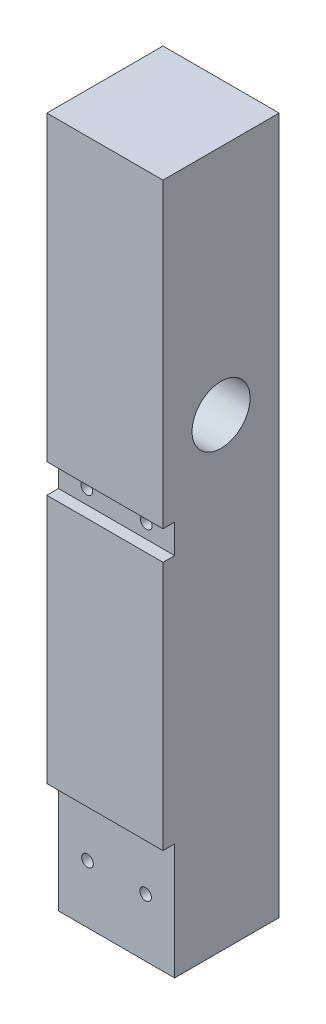
ISO-10303-21;
HEADER;
FILE_DESCRIPTION(('STEP AP214'),'2;1');
FILE_NAME('part.step','',(''),(''),'','','');
FILE_SCHEMA(('AUTOMOTIVE_DESIGN { 1 0 10303 214 1 1 1 1 }'));
ENDSEC;
DATA;
#1=APPLICATION_CONTEXT('core data for automotive mechanical design processes');
#2=APPLICATION_PROTOCOL_DEFINITION('international standard','automotive_design',2000,#1);
#3=PRODUCT_CONTEXT('',#1,'mechanical');
#4=PRODUCT('Part','Part','',(#3));
#5=PRODUCT_RELATED_PRODUCT_CATEGORY('part','',(#4));
#6=PRODUCT_DEFINITION_FORMATION('','',#4);
#7=PRODUCT_DEFINITION_CONTEXT('part definition',#1,'design');
#8=PRODUCT_DEFINITION('design','',#6,#7);
#9=PRODUCT_DEFINITION_SHAPE('','',#8);
#10=(LENGTH_UNIT() NAMED_UNIT(*) SI_UNIT(.MILLI.,.METRE.));
#11=(NAMED_UNIT(*) PLANE_ANGLE_UNIT() SI_UNIT($,.RADIAN.));
#12=(NAMED_UNIT(*) SI_UNIT($,.STERADIAN.) SOLID_ANGLE_UNIT());
#13=UNCERTAINTY_MEASURE_WITH_UNIT(LENGTH_MEASURE(1.E-05),#10,'distance_accuracy_value','');
#14=(GEOMETRIC_REPRESENTATION_CONTEXT(3) GLOBAL_UNCERTAINTY_ASSIGNED_CONTEXT((#13)) GLOBAL_UNIT_ASSIGNED_CONTEXT((#10,
#11,#12)) REPRESENTATION_CONTEXT('',''));
#15=CARTESIAN_POINT('',(0.,0.,0.));
#16=DIRECTION('',(0.,0.,1.));
#17=DIRECTION('',(1.,0.,0.));
#18=AXIS2_PLACEMENT_3D('',#15,#16,#17);
#19=CARTESIAN_POINT('',(-15.119461257796,65.5,0.));
#20=DIRECTION('',(0.,0.,-1.));
#21=DIRECTION('',(0.,1.,0.));
#22=AXIS2_PLACEMENT_3D('',#19,#20,#21);
#23=CYLINDRICAL_SURFACE('',#22,1.);
#24=CARTESIAN_POINT('',(-15.119461257796,65.5,-15.));
#25=DIRECTION('',(0.,0.,-1.));
#26=DIRECTION('',(0.,1.,0.));
#27=AXIS2_PLACEMENT_3D('',#24,#25,#26);
#28=CIRCLE('',#27,1.);
#29=CARTESIAN_POINT('',(-15.119461257796,66.5,-15.));
#30=VERTEX_POINT('',#29);
#31=EDGE_CURVE('E42',#30,#30,#28,.T.);
#32=ORIENTED_EDGE('',*,*,#31,.T.);
#33=EDGE_LOOP('',(#32));
#34=FACE_BOUND('',#33,.T.);
#35=CARTESIAN_POINT('',(-15.119461257796,65.5,-2.));
#36=DIRECTION('',(0.,0.,1.));
#37=DIRECTION('',(1.,0.,0.));
#38=AXIS2_PLACEMENT_3D('',#35,#36,#37);
#39=CIRCLE('',#38,1.);
#40=CARTESIAN_POINT('',(-14.119461257796,65.5,-2.));
#41=VERTEX_POINT('',#40);
#42=EDGE_CURVE('E173',#41,#41,#39,.T.);
#43=ORIENTED_EDGE('',*,*,#42,.T.);
#44=EDGE_LOOP('',(#43));
#45=FACE_BOUND('',#44,.T.);
#46=ADVANCED_FACE('F38',(#34,#45),#23,.F.);
#47=CARTESIAN_POINT('',(-4.88053874220398,65.5,0.));
#48=DIRECTION('',(0.,0.,-1.));
#49=DIRECTION('',(0.,1.,0.));
#50=AXIS2_PLACEMENT_3D('',#47,#48,#49);
#51=CYLINDRICAL_SURFACE('',#50,1.);
#52=CARTESIAN_POINT('',(-4.88053874220398,65.5,-15.));
#53=DIRECTION('',(0.,0.,-1.));
#54=DIRECTION('',(0.,1.,0.));
#55=AXIS2_PLACEMENT_3D('',#52,#53,#54);
#56=CIRCLE('',#55,1.);
#57=CARTESIAN_POINT('',(-4.88053874220398,66.5,-15.));
#58=VERTEX_POINT('',#57);
#59=EDGE_CURVE('E180',#58,#58,#56,.F.);
#60=ORIENTED_EDGE('',*,*,#59,.F.);
#61=EDGE_LOOP('',(#60));
#62=FACE_BOUND('',#61,.T.);
#63=CARTESIAN_POINT('',(-4.88053874220398,65.5,-2.));
#64=DIRECTION('',(0.,0.,1.));
#65=DIRECTION('',(1.,0.,0.));
#66=AXIS2_PLACEMENT_3D('',#63,#64,#65);
#67=CIRCLE('',#66,1.);
#68=CARTESIAN_POINT('',(-3.88053874220398,65.5,-2.));
#69=VERTEX_POINT('',#68);
#70=EDGE_CURVE('E170',#69,#69,#67,.F.);
#71=ORIENTED_EDGE('',*,*,#70,.F.);
#72=EDGE_LOOP('',(#71));
#73=FACE_BOUND('',#72,.T.);
#74=ADVANCED_FACE('F321',(#62,#73),#51,.F.);
#75=CARTESIAN_POINT('',(-20.,120.,0.));
#76=DIRECTION('',(0.,0.,1.));
#77=DIRECTION('',(0.,-1.,0.));
#78=AXIS2_PLACEMENT_3D('',#75,#76,#77);
#79=PLANE('',#78);
#80=DIRECTION('',(1.,0.,0.));
#81=VECTOR('',#80,1.);
#82=CARTESIAN_POINT('',(-20.,63.,0.));
#83=LINE('',#82,#81);
#84=CARTESIAN_POINT('',(-20.,63.,0.));
#85=VERTEX_POINT('',#84);
#86=CARTESIAN_POINT('',(0.,63.,0.));
#87=VERTEX_POINT('',#86);
#88=EDGE_CURVE('E133',#85,#87,#83,.T.);
#89=ORIENTED_EDGE('',*,*,#88,.F.);
#90=DIRECTION('',(0.,-1.,0.));
#91=VECTOR('',#90,1.);
#92=CARTESIAN_POINT('',(-20.,120.,0.));
#93=LINE('',#92,#91);
#94=CARTESIAN_POINT('',(-20.,20.,0.));
#95=VERTEX_POINT('',#94);
#96=EDGE_CURVE('E218',#85,#95,#93,.T.);
#97=ORIENTED_EDGE('',*,*,#96,.T.);
#98=DIRECTION('',(-1.,0.,0.));
#99=VECTOR('',#98,1.);
#100=CARTESIAN_POINT('',(-20.,20.,0.));
#101=LINE('',#100,#99);
#102=CARTESIAN_POINT('',(0.,20.,0.));
#103=VERTEX_POINT('',#102);
#104=EDGE_CURVE('E150',#103,#95,#101,.T.);
#105=ORIENTED_EDGE('',*,*,#104,.F.);
#106=DIRECTION('',(0.,-1.,0.));
#107=VECTOR('',#106,1.);
#108=CARTESIAN_POINT('',(0.,120.,0.));
#109=LINE('',#108,#107);
#110=EDGE_CURVE('E213',#87,#103,#109,.T.);
#111=ORIENTED_EDGE('',*,*,#110,.F.);
#112=EDGE_LOOP('',(#89,#97,#105,#111));
#113=FACE_BOUND('',#112,.T.);
#114=ADVANCED_FACE('F298',(#113),#79,.T.);
#115=CARTESIAN_POINT('',(-5.,9.99999999999999,-20.));
#116=DIRECTION('',(0.,0.,1.));
#117=DIRECTION('',(1.,0.,0.));
#118=AXIS2_PLACEMENT_3D('',#115,#116,#117);
#119=CYLINDRICAL_SURFACE('',#118,1.);
#120=CARTESIAN_POINT('',(-5.,9.99999999999999,-15.));
#121=DIRECTION('',(0.,0.,-1.));
#122=DIRECTION('',(0.,1.,0.));
#123=AXIS2_PLACEMENT_3D('',#120,#121,#122);
#124=CIRCLE('',#123,1.);
#125=CARTESIAN_POINT('',(-5.,11.,-15.));
#126=VERTEX_POINT('',#125);
#127=EDGE_CURVE('E209',#126,#126,#124,.T.);
#128=ORIENTED_EDGE('',*,*,#127,.T.);
#129=EDGE_LOOP('',(#128));
#130=FACE_BOUND('',#129,.T.);
#131=CARTESIAN_POINT('',(-5.,9.99999999999999,-2.));
#132=DIRECTION('',(0.,0.,1.));
#133=DIRECTION('',(1.,0.,0.));
#134=AXIS2_PLACEMENT_3D('',#131,#132,#133);
#135=CIRCLE('',#134,1.);
#136=CARTESIAN_POINT('',(-4.,9.99999999999999,-2.));
#137=VERTEX_POINT('',#136);
#138=EDGE_CURVE('E166',#137,#137,#135,.T.);
#139=ORIENTED_EDGE('',*,*,#138,.T.);
#140=EDGE_LOOP('',(#139));
#141=FACE_BOUND('',#140,.T.);
#142=ADVANCED_FACE('F317',(#130,#141),#119,.F.);
#143=CARTESIAN_POINT('',(-15.,9.99999999999999,-20.));
#144=DIRECTION('',(0.,0.,1.));
#145=DIRECTION('',(1.,0.,0.));
#146=AXIS2_PLACEMENT_3D('',#143,#144,#145);
#147=CYLINDRICAL_SURFACE('',#146,1.);
#148=CARTESIAN_POINT('',(-15.,9.99999999999999,-15.));
#149=DIRECTION('',(0.,0.,-1.));
#150=DIRECTION('',(0.,1.,0.));
#151=AXIS2_PLACEMENT_3D('',#148,#149,#150);
#152=CIRCLE('',#151,1.);
#153=CARTESIAN_POINT('',(-15.,11.,-15.));
#154=VERTEX_POINT('',#153);
#155=EDGE_CURVE('E192',#154,#154,#152,.F.);
#156=ORIENTED_EDGE('',*,*,#155,.F.);
#157=EDGE_LOOP('',(#156));
#158=FACE_BOUND('',#157,.T.);
#159=CARTESIAN_POINT('',(-15.,9.99999999999999,-2.));
#160=DIRECTION('',(0.,0.,1.));
#161=DIRECTION('',(1.,0.,0.));
#162=AXIS2_PLACEMENT_3D('',#159,#160,#161);
#163=CIRCLE('',#162,1.);
#164=CARTESIAN_POINT('',(-14.,9.99999999999999,-2.));
#165=VERTEX_POINT('',#164);
#166=EDGE_CURVE('E163',#165,#165,#163,.F.);
#167=ORIENTED_EDGE('',*,*,#166,.F.);
#168=EDGE_LOOP('',(#167));
#169=FACE_BOUND('',#168,.T.);
#170=ADVANCED_FACE('F312',(#158,#169),#147,.F.);
#171=CARTESIAN_POINT('',(-20.,0.,0.));
#172=DIRECTION('',(0.,-1.,0.));
#173=DIRECTION('',(0.,0.,-1.));
#174=AXIS2_PLACEMENT_3D('',#171,#172,#173);
#175=PLANE('',#174);
#176=DIRECTION('',(0.,0.,-1.));
#177=VECTOR('',#176,1.);
#178=CARTESIAN_POINT('',(0.,0.,0.));
#179=LINE('',#178,#177);
#180=CARTESIAN_POINT('',(0.,0.,-2.));
#181=VERTEX_POINT('',#180);
#182=CARTESIAN_POINT('',(0.,0.,-20.));
#183=VERTEX_POINT('',#182);
#184=EDGE_CURVE('E228',#181,#183,#179,.T.);
#185=ORIENTED_EDGE('',*,*,#184,.F.);
#186=DIRECTION('',(1.,0.,0.));
#187=VECTOR('',#186,1.);
#188=CARTESIAN_POINT('',(-20.,0.,-2.));
#189=LINE('',#188,#187);
#190=CARTESIAN_POINT('',(-20.,0.,-2.));
#191=VERTEX_POINT('',#190);
#192=EDGE_CURVE('E63',#191,#181,#189,.T.);
#193=ORIENTED_EDGE('',*,*,#192,.F.);
#194=DIRECTION('',(0.,0.,-1.));
#195=VECTOR('',#194,1.);
#196=CARTESIAN_POINT('',(-20.,0.,0.));
#197=LINE('',#196,#195);
#198=CARTESIAN_POINT('',(-20.,0.,-20.));
#199=VERTEX_POINT('',#198);
#200=EDGE_CURVE('E217',#191,#199,#197,.T.);
#201=ORIENTED_EDGE('',*,*,#200,.T.);
#202=DIRECTION('',(1.,0.,0.));
#203=VECTOR('',#202,1.);
#204=CARTESIAN_POINT('',(-20.,0.,-20.));
#205=LINE('',#204,#203);
#206=EDGE_CURVE('E226',#199,#183,#205,.T.);
#207=ORIENTED_EDGE('',*,*,#206,.T.);
#208=EDGE_LOOP('',(#185,#193,#201,#207));
#209=FACE_BOUND('',#208,.T.);
#210=ADVANCED_FACE('F310',(#209),#175,.T.);
#211=DIRECTION('',(-1.,0.,0.));
#212=VECTOR('',#211,1.);
#213=CARTESIAN_POINT('',(-20.,68.,0.));
#214=LINE('',#213,#212);
#215=CARTESIAN_POINT('',(0.,68.,0.));
#216=VERTEX_POINT('',#215);
#217=CARTESIAN_POINT('',(-20.,68.,0.));
#218=VERTEX_POINT('',#217);
#219=EDGE_CURVE('E161',#216,#218,#214,.T.);
#220=ORIENTED_EDGE('',*,*,#219,.F.);
#221=CARTESIAN_POINT('',(0.,120.,0.));
#222=VERTEX_POINT('',#221);
#223=EDGE_CURVE('E140',#222,#216,#109,.T.);
#224=ORIENTED_EDGE('',*,*,#223,.F.);
#225=DIRECTION('',(1.,0.,0.));
#226=VECTOR('',#225,1.);
#227=CARTESIAN_POINT('',(-20.,120.,0.));
#228=LINE('',#227,#226);
#229=CARTESIAN_POINT('',(-20.,120.,0.));
#230=VERTEX_POINT('',#229);
#231=EDGE_CURVE('E12',#230,#222,#228,.T.);
#232=ORIENTED_EDGE('',*,*,#231,.F.);
#233=EDGE_CURVE('E214',#230,#218,#93,.T.);
#234=ORIENTED_EDGE('',*,*,#233,.T.);
#235=EDGE_LOOP('',(#220,#224,#232,#234));
#236=FACE_BOUND('',#235,.T.);
#237=ADVANCED_FACE('F40',(#236),#79,.T.);
#238=CARTESIAN_POINT('',(-20.,120.,-20.));
#239=DIRECTION('',(0.,0.,-1.));
#240=DIRECTION('',(0.,1.,0.));
#241=AXIS2_PLACEMENT_3D('',#238,#239,#240);
#242=PLANE('',#241);
#243=CARTESIAN_POINT('',(-4.88053874220398,65.5,-20.));
#244=DIRECTION('',(0.,0.,-1.));
#245=DIRECTION('',(0.,1.,0.));
#246=AXIS2_PLACEMENT_3D('',#243,#244,#245);
#247=CIRCLE('',#246,2.);
#248=CARTESIAN_POINT('',(-4.88053874220398,67.5,-20.));
#249=VERTEX_POINT('',#248);
#250=EDGE_CURVE('E181',#249,#249,#247,.T.);
#251=ORIENTED_EDGE('',*,*,#250,.F.);
#252=EDGE_LOOP('',(#251));
#253=FACE_BOUND('',#252,.T.);
#254=CARTESIAN_POINT('',(-15.119461257796,65.5,-20.));
#255=DIRECTION('',(0.,0.,-1.));
#256=DIRECTION('',(0.,1.,0.));
#257=AXIS2_PLACEMENT_3D('',#254,#255,#256);
#258=CIRCLE('',#257,2.);
#259=CARTESIAN_POINT('',(-15.119461257796,67.5,-20.));
#260=VERTEX_POINT('',#259);
#261=EDGE_CURVE('E176',#260,#260,#258,.T.);
#262=ORIENTED_EDGE('',*,*,#261,.F.);
#263=EDGE_LOOP('',(#262));
#264=FACE_BOUND('',#263,.T.);
#265=CARTESIAN_POINT('',(-5.,9.99999999999999,-20.));
#266=DIRECTION('',(0.,0.,-1.));
#267=DIRECTION('',(0.,1.,0.));
#268=AXIS2_PLACEMENT_3D('',#265,#266,#267);
#269=CIRCLE('',#268,2.);
#270=CARTESIAN_POINT('',(-5.,12.,-20.));
#271=VERTEX_POINT('',#270);
#272=EDGE_CURVE('E193',#271,#271,#269,.T.);
#273=ORIENTED_EDGE('',*,*,#272,.F.);
#274=EDGE_LOOP('',(#273));
#275=FACE_BOUND('',#274,.T.);
#276=CARTESIAN_POINT('',(-15.,9.99999999999999,-20.));
#277=DIRECTION('',(0.,0.,-1.));
#278=DIRECTION('',(0.,1.,0.));
#279=AXIS2_PLACEMENT_3D('',#276,#277,#278);
#280=CIRCLE('',#279,2.);
#281=CARTESIAN_POINT('',(-15.,12.,-20.));
#282=VERTEX_POINT('',#281);
#283=EDGE_CURVE('E199',#282,#282,#280,.T.);
#284=ORIENTED_EDGE('',*,*,#283,.F.);
#285=EDGE_LOOP('',(#284));
#286=FACE_BOUND('',#285,.T.);
#287=DIRECTION('',(0.,1.,0.));
#288=VECTOR('',#287,1.);
#289=CARTESIAN_POINT('',(0.,120.,-20.));
#290=LINE('',#289,#288);
#291=CARTESIAN_POINT('',(0.,120.,-20.));
#292=VERTEX_POINT('',#291);
#293=EDGE_CURVE('E230',#183,#292,#290,.T.);
#294=ORIENTED_EDGE('',*,*,#293,.F.);
#295=ORIENTED_EDGE('',*,*,#206,.F.);
#296=DIRECTION('',(0.,1.,0.));
#297=VECTOR('',#296,1.);
#298=CARTESIAN_POINT('',(-20.,120.,-20.));
#299=LINE('',#298,#297);
#300=CARTESIAN_POINT('',(-20.,120.,-20.));
#301=VERTEX_POINT('',#300);
#302=EDGE_CURVE('E220',#199,#301,#299,.T.);
#303=ORIENTED_EDGE('',*,*,#302,.T.);
#304=DIRECTION('',(1.,0.,0.));
#305=VECTOR('',#304,1.);
#306=CARTESIAN_POINT('',(-20.,120.,-20.));
#307=LINE('',#306,#305);
#308=EDGE_CURVE('E47',#301,#292,#307,.T.);
#309=ORIENTED_EDGE('',*,*,#308,.T.);
#310=EDGE_LOOP('',(#294,#295,#303,#309));
#311=FACE_BOUND('',#310,.T.);
#312=ADVANCED_FACE('F265',(#253,#264,#275,#286,#311),#242,.T.);
#313=CARTESIAN_POINT('',(-20.,80.,-10.));
#314=DIRECTION('',(1.,0.,0.));
#315=DIRECTION('',(0.,0.,-1.));
#316=AXIS2_PLACEMENT_3D('',#313,#314,#315);
#317=CYLINDRICAL_SURFACE('',#316,2.5);
#318=CARTESIAN_POINT('',(-20.,80.,-10.));
#319=DIRECTION('',(1.,0.,0.));
#320=DIRECTION('',(0.,0.,-1.));
#321=AXIS2_PLACEMENT_3D('',#318,#319,#320);
#322=CIRCLE('',#321,2.5);
#323=CARTESIAN_POINT('',(-20.,80.,-12.5));
#324=VERTEX_POINT('',#323);
#325=EDGE_CURVE('E210',#324,#324,#322,.T.);
#326=ORIENTED_EDGE('',*,*,#325,.F.);
#327=EDGE_LOOP('',(#326));
#328=FACE_BOUND('',#327,.T.);
#329=CARTESIAN_POINT('',(-10.,80.,-10.));
#330=DIRECTION('',(1.,0.,0.));
#331=DIRECTION('',(0.,0.,-1.));
#332=AXIS2_PLACEMENT_3D('',#329,#330,#331);
#333=CIRCLE('',#332,2.5);
#334=CARTESIAN_POINT('',(-10.,80.,-12.5));
#335=VERTEX_POINT('',#334);
#336=EDGE_CURVE('E205',#335,#335,#333,.F.);
#337=ORIENTED_EDGE('',*,*,#336,.F.);
#338=EDGE_LOOP('',(#337));
#339=FACE_BOUND('',#338,.T.);
#340=ADVANCED_FACE('F268',(#328,#339),#317,.F.);
#341=CARTESIAN_POINT('',(-20.,120.,0.));
#342=DIRECTION('',(0.,1.,0.));
#343=DIRECTION('',(0.,0.,1.));
#344=AXIS2_PLACEMENT_3D('',#341,#342,#343);
#345=PLANE('',#344);
#346=DIRECTION('',(0.,0.,1.));
#347=VECTOR('',#346,1.);
#348=CARTESIAN_POINT('',(0.,120.,0.));
#349=LINE('',#348,#347);
#350=EDGE_CURVE('E233',#292,#222,#349,.T.);
#351=ORIENTED_EDGE('',*,*,#350,.F.);
#352=ORIENTED_EDGE('',*,*,#308,.F.);
#353=DIRECTION('',(0.,0.,1.));
#354=VECTOR('',#353,1.);
#355=CARTESIAN_POINT('',(-20.,120.,0.));
#356=LINE('',#355,#354);
#357=EDGE_CURVE('E223',#301,#230,#356,.T.);
#358=ORIENTED_EDGE('',*,*,#357,.T.);
#359=ORIENTED_EDGE('',*,*,#231,.T.);
#360=EDGE_LOOP('',(#351,#352,#358,#359));
#361=FACE_BOUND('',#360,.T.);
#362=ADVANCED_FACE('F281',(#361),#345,.T.);
#363=CARTESIAN_POINT('',(-20.,0.,0.));
#364=DIRECTION('',(1.,0.,0.));
#365=DIRECTION('',(0.,0.,-1.));
#366=AXIS2_PLACEMENT_3D('',#363,#364,#365);
#367=PLANE('',#366);
#368=ORIENTED_EDGE('',*,*,#96,.F.);
#369=DIRECTION('',(0.,0.,1.));
#370=VECTOR('',#369,1.);
#371=CARTESIAN_POINT('',(-20.,63.,-2.));
#372=LINE('',#371,#370);
#373=CARTESIAN_POINT('',(-20.,63.,-2.));
#374=VERTEX_POINT('',#373);
#375=EDGE_CURVE('E142',#374,#85,#372,.T.);
#376=ORIENTED_EDGE('',*,*,#375,.F.);
#377=DIRECTION('',(0.,-1.,0.));
#378=VECTOR('',#377,1.);
#379=CARTESIAN_POINT('',(-20.,68.,-2.));
#380=LINE('',#379,#378);
#381=CARTESIAN_POINT('',(-20.,68.,-2.));
#382=VERTEX_POINT('',#381);
#383=EDGE_CURVE('E125',#382,#374,#380,.T.);
#384=ORIENTED_EDGE('',*,*,#383,.F.);
#385=DIRECTION('',(0.,0.,1.));
#386=VECTOR('',#385,1.);
#387=CARTESIAN_POINT('',(-20.,68.,-2.));
#388=LINE('',#387,#386);
#389=EDGE_CURVE('E123',#382,#218,#388,.T.);
#390=ORIENTED_EDGE('',*,*,#389,.T.);
#391=ORIENTED_EDGE('',*,*,#233,.F.);
#392=ORIENTED_EDGE('',*,*,#357,.F.);
#393=ORIENTED_EDGE('',*,*,#302,.F.);
#394=ORIENTED_EDGE('',*,*,#200,.F.);
#395=DIRECTION('',(0.,-1.,0.));
#396=VECTOR('',#395,1.);
#397=CARTESIAN_POINT('',(-20.,20.,-2.));
#398=LINE('',#397,#396);
#399=CARTESIAN_POINT('',(-20.,20.,-2.));
#400=VERTEX_POINT('',#399);
#401=EDGE_CURVE('E153',#400,#191,#398,.T.);
#402=ORIENTED_EDGE('',*,*,#401,.F.);
#403=DIRECTION('',(0.,0.,1.));
#404=VECTOR('',#403,1.);
#405=CARTESIAN_POINT('',(-20.,20.,-2.));
#406=LINE('',#405,#404);
#407=EDGE_CURVE('E158',#400,#95,#406,.T.);
#408=ORIENTED_EDGE('',*,*,#407,.T.);
#409=EDGE_LOOP('',(#368,#376,#384,#390,#391,#392,#393,#394,#402,#408));
#410=FACE_BOUND('',#409,.T.);
#411=ORIENTED_EDGE('',*,*,#325,.T.);
#412=EDGE_LOOP('',(#411));
#413=FACE_BOUND('',#412,.T.);
#414=ADVANCED_FACE('F301',(#410,#413),#367,.F.);
#415=CARTESIAN_POINT('',(0.,0.,0.));
#416=DIRECTION('',(1.,0.,0.));
#417=DIRECTION('',(0.,0.,-1.));
#418=AXIS2_PLACEMENT_3D('',#415,#416,#417);
#419=PLANE('',#418);
#420=DIRECTION('',(0.,0.,1.));
#421=VECTOR('',#420,1.);
#422=CARTESIAN_POINT('',(0.,63.,-2.));
#423=LINE('',#422,#421);
#424=CARTESIAN_POINT('',(0.,63.,-2.));
#425=VERTEX_POINT('',#424);
#426=EDGE_CURVE('E167',#425,#87,#423,.T.);
#427=ORIENTED_EDGE('',*,*,#426,.T.);
#428=ORIENTED_EDGE('',*,*,#110,.T.);
#429=DIRECTION('',(0.,0.,1.));
#430=VECTOR('',#429,1.);
#431=CARTESIAN_POINT('',(0.,20.,-2.));
#432=LINE('',#431,#430);
#433=CARTESIAN_POINT('',(0.,20.,-2.));
#434=VERTEX_POINT('',#433);
#435=EDGE_CURVE('E156',#434,#103,#432,.T.);
#436=ORIENTED_EDGE('',*,*,#435,.F.);
#437=DIRECTION('',(0.,1.,0.));
#438=VECTOR('',#437,1.);
#439=CARTESIAN_POINT('',(0.,20.,-2.));
#440=LINE('',#439,#438);
#441=EDGE_CURVE('E147',#181,#434,#440,.T.);
#442=ORIENTED_EDGE('',*,*,#441,.F.);
#443=ORIENTED_EDGE('',*,*,#184,.T.);
#444=ORIENTED_EDGE('',*,*,#293,.T.);
#445=ORIENTED_EDGE('',*,*,#350,.T.);
#446=ORIENTED_EDGE('',*,*,#223,.T.);
#447=DIRECTION('',(0.,0.,1.));
#448=VECTOR('',#447,1.);
#449=CARTESIAN_POINT('',(0.,68.,-2.));
#450=LINE('',#449,#448);
#451=CARTESIAN_POINT('',(0.,68.,-2.));
#452=VERTEX_POINT('',#451);
#453=EDGE_CURVE('E120',#452,#216,#450,.T.);
#454=ORIENTED_EDGE('',*,*,#453,.F.);
#455=DIRECTION('',(0.,1.,0.));
#456=VECTOR('',#455,1.);
#457=CARTESIAN_POINT('',(0.,68.,-2.));
#458=LINE('',#457,#456);
#459=EDGE_CURVE('E126',#425,#452,#458,.T.);
#460=ORIENTED_EDGE('',*,*,#459,.F.);
#461=EDGE_LOOP('',(#427,#428,#436,#442,#443,#444,#445,#446,#454,#460));
#462=FACE_BOUND('',#461,.T.);
#463=CARTESIAN_POINT('',(0.,80.,-10.));
#464=DIRECTION('',(1.,0.,0.));
#465=DIRECTION('',(0.,0.,-1.));
#466=AXIS2_PLACEMENT_3D('',#463,#464,#465);
#467=CIRCLE('',#466,5.);
#468=CARTESIAN_POINT('',(0.,80.,-15.));
#469=VERTEX_POINT('',#468);
#470=EDGE_CURVE('E206',#469,#469,#467,.T.);
#471=ORIENTED_EDGE('',*,*,#470,.F.);
#472=EDGE_LOOP('',(#471));
#473=FACE_BOUND('',#472,.T.);
#474=ADVANCED_FACE('F136',(#462,#473),#419,.T.);
#475=CARTESIAN_POINT('',(-10.,80.,-10.));
#476=DIRECTION('',(1.,0.,0.));
#477=DIRECTION('',(0.,0.,-1.));
#478=AXIS2_PLACEMENT_3D('',#475,#476,#477);
#479=PLANE('',#478);
#480=CARTESIAN_POINT('',(-10.,80.,-10.));
#481=DIRECTION('',(1.,0.,0.));
#482=DIRECTION('',(0.,0.,-1.));
#483=AXIS2_PLACEMENT_3D('',#480,#481,#482);
#484=CIRCLE('',#483,5.);
#485=CARTESIAN_POINT('',(-10.,80.,-15.));
#486=VERTEX_POINT('',#485);
#487=EDGE_CURVE('E202',#486,#486,#484,.T.);
#488=ORIENTED_EDGE('',*,*,#487,.T.);
#489=EDGE_LOOP('',(#488));
#490=FACE_BOUND('',#489,.T.);
#491=ORIENTED_EDGE('',*,*,#336,.T.);
#492=EDGE_LOOP('',(#491));
#493=FACE_BOUND('',#492,.T.);
#494=ADVANCED_FACE('F350',(#490,#493),#479,.T.);
#495=CARTESIAN_POINT('',(-10.,80.,-10.));
#496=DIRECTION('',(1.,0.,0.));
#497=DIRECTION('',(0.,0.,-1.));
#498=AXIS2_PLACEMENT_3D('',#495,#496,#497);
#499=CYLINDRICAL_SURFACE('',#498,5.);
#500=ORIENTED_EDGE('',*,*,#487,.F.);
#501=EDGE_LOOP('',(#500));
#502=FACE_BOUND('',#501,.T.);
#503=ORIENTED_EDGE('',*,*,#470,.T.);
#504=EDGE_LOOP('',(#503));
#505=FACE_BOUND('',#504,.T.);
#506=ADVANCED_FACE('F342',(#502,#505),#499,.F.);
#507=CARTESIAN_POINT('',(-15.,9.99999999999999,-15.));
#508=DIRECTION('',(0.,0.,-1.));
#509=DIRECTION('',(0.,1.,0.));
#510=AXIS2_PLACEMENT_3D('',#507,#508,#509);
#511=PLANE('',#510);
#512=CARTESIAN_POINT('',(-15.,9.99999999999999,-15.));
#513=DIRECTION('',(0.,0.,-1.));
#514=DIRECTION('',(0.,1.,0.));
#515=AXIS2_PLACEMENT_3D('',#512,#513,#514);
#516=CIRCLE('',#515,2.);
#517=CARTESIAN_POINT('',(-15.,12.,-15.));
#518=VERTEX_POINT('',#517);
#519=EDGE_CURVE('E196',#518,#518,#516,.T.);
#520=ORIENTED_EDGE('',*,*,#519,.T.);
#521=EDGE_LOOP('',(#520));
#522=FACE_BOUND('',#521,.T.);
#523=ORIENTED_EDGE('',*,*,#155,.T.);
#524=EDGE_LOOP('',(#523));
#525=FACE_BOUND('',#524,.T.);
#526=ADVANCED_FACE('F339',(#522,#525),#511,.T.);
#527=CARTESIAN_POINT('',(-15.,9.99999999999999,-15.));
#528=DIRECTION('',(0.,0.,-1.));
#529=DIRECTION('',(0.,1.,0.));
#530=AXIS2_PLACEMENT_3D('',#527,#528,#529);
#531=CYLINDRICAL_SURFACE('',#530,2.);
#532=ORIENTED_EDGE('',*,*,#519,.F.);
#533=EDGE_LOOP('',(#532));
#534=FACE_BOUND('',#533,.T.);
#535=ORIENTED_EDGE('',*,*,#283,.T.);
#536=EDGE_LOOP('',(#535));
#537=FACE_BOUND('',#536,.T.);
#538=ADVANCED_FACE('F337',(#534,#537),#531,.F.);
#539=CARTESIAN_POINT('',(-5.,9.99999999999999,-15.));
#540=DIRECTION('',(0.,0.,-1.));
#541=DIRECTION('',(0.,1.,0.));
#542=AXIS2_PLACEMENT_3D('',#539,#540,#541);
#543=CYLINDRICAL_SURFACE('',#542,2.);
#544=CARTESIAN_POINT('',(-5.,9.99999999999999,-15.));
#545=DIRECTION('',(0.,0.,-1.));
#546=DIRECTION('',(0.,1.,0.));
#547=AXIS2_PLACEMENT_3D('',#544,#545,#546);
#548=CIRCLE('',#547,2.);
#549=CARTESIAN_POINT('',(-5.,12.,-15.));
#550=VERTEX_POINT('',#549);
#551=EDGE_CURVE('E189',#550,#550,#548,.T.);
#552=ORIENTED_EDGE('',*,*,#551,.F.);
#553=EDGE_LOOP('',(#552));
#554=FACE_BOUND('',#553,.T.);
#555=ORIENTED_EDGE('',*,*,#272,.T.);
#556=EDGE_LOOP('',(#555));
#557=FACE_BOUND('',#556,.T.);
#558=ADVANCED_FACE('F333',(#554,#557),#543,.F.);
#559=CARTESIAN_POINT('',(-5.,9.99999999999999,-15.));
#560=DIRECTION('',(0.,0.,-1.));
#561=DIRECTION('',(0.,1.,0.));
#562=AXIS2_PLACEMENT_3D('',#559,#560,#561);
#563=PLANE('',#562);
#564=ORIENTED_EDGE('',*,*,#127,.F.);
#565=EDGE_LOOP('',(#564));
#566=FACE_BOUND('',#565,.T.);
#567=ORIENTED_EDGE('',*,*,#551,.T.);
#568=EDGE_LOOP('',(#567));
#569=FACE_BOUND('',#568,.T.);
#570=ADVANCED_FACE('F329',(#566,#569),#563,.T.);
#571=CARTESIAN_POINT('',(-4.88053874220398,65.5,-15.));
#572=DIRECTION('',(0.,0.,-1.));
#573=DIRECTION('',(0.,1.,0.));
#574=AXIS2_PLACEMENT_3D('',#571,#572,#573);
#575=PLANE('',#574);
#576=CARTESIAN_POINT('',(-4.88053874220398,65.5,-15.));
#577=DIRECTION('',(0.,0.,-1.));
#578=DIRECTION('',(0.,1.,0.));
#579=AXIS2_PLACEMENT_3D('',#576,#577,#578);
#580=CIRCLE('',#579,2.);
#581=CARTESIAN_POINT('',(-4.88053874220398,67.5,-15.));
#582=VERTEX_POINT('',#581);
#583=EDGE_CURVE('E177',#582,#582,#580,.T.);
#584=ORIENTED_EDGE('',*,*,#583,.T.);
#585=EDGE_LOOP('',(#584));
#586=FACE_BOUND('',#585,.T.);
#587=ORIENTED_EDGE('',*,*,#59,.T.);
#588=EDGE_LOOP('',(#587));
#589=FACE_BOUND('',#588,.T.);
#590=ADVANCED_FACE('F332',(#586,#589),#575,.T.);
#591=CARTESIAN_POINT('',(-4.88053874220398,65.5,-15.));
#592=DIRECTION('',(0.,0.,-1.));
#593=DIRECTION('',(0.,1.,0.));
#594=AXIS2_PLACEMENT_3D('',#591,#592,#593);
#595=CYLINDRICAL_SURFACE('',#594,2.);
#596=ORIENTED_EDGE('',*,*,#583,.F.);
#597=EDGE_LOOP('',(#596));
#598=FACE_BOUND('',#597,.T.);
#599=ORIENTED_EDGE('',*,*,#250,.T.);
#600=EDGE_LOOP('',(#599));
#601=FACE_BOUND('',#600,.T.);
#602=ADVANCED_FACE('F261',(#598,#601),#595,.F.);
#603=CARTESIAN_POINT('',(-15.119461257796,65.5,-15.));
#604=DIRECTION('',(0.,0.,-1.));
#605=DIRECTION('',(0.,1.,0.));
#606=AXIS2_PLACEMENT_3D('',#603,#604,#605);
#607=CYLINDRICAL_SURFACE('',#606,2.);
#608=CARTESIAN_POINT('',(-15.119461257796,65.5,-15.));
#609=DIRECTION('',(0.,0.,-1.));
#610=DIRECTION('',(0.,1.,0.));
#611=AXIS2_PLACEMENT_3D('',#608,#609,#610);
#612=CIRCLE('',#611,2.);
#613=CARTESIAN_POINT('',(-15.119461257796,67.5,-15.));
#614=VERTEX_POINT('',#613);
#615=EDGE_CURVE('E184',#614,#614,#612,.T.);
#616=ORIENTED_EDGE('',*,*,#615,.F.);
#617=EDGE_LOOP('',(#616));
#618=FACE_BOUND('',#617,.T.);
#619=ORIENTED_EDGE('',*,*,#261,.T.);
#620=EDGE_LOOP('',(#619));
#621=FACE_BOUND('',#620,.T.);
#622=ADVANCED_FACE('F255',(#618,#621),#607,.F.);
#623=CARTESIAN_POINT('',(-15.119461257796,65.5,-15.));
#624=DIRECTION('',(0.,0.,-1.));
#625=DIRECTION('',(0.,1.,0.));
#626=AXIS2_PLACEMENT_3D('',#623,#624,#625);
#627=PLANE('',#626);
#628=ORIENTED_EDGE('',*,*,#31,.F.);
#629=EDGE_LOOP('',(#628));
#630=FACE_BOUND('',#629,.T.);
#631=ORIENTED_EDGE('',*,*,#615,.T.);
#632=EDGE_LOOP('',(#631));
#633=FACE_BOUND('',#632,.T.);
#634=ADVANCED_FACE('F251',(#630,#633),#627,.T.);
#635=CARTESIAN_POINT('',(0.,0.,-2.));
#636=DIRECTION('',(0.,0.,1.));
#637=DIRECTION('',(1.,0.,0.));
#638=AXIS2_PLACEMENT_3D('',#635,#636,#637);
#639=PLANE('',#638);
#640=ORIENTED_EDGE('',*,*,#138,.F.);
#641=EDGE_LOOP('',(#640));
#642=FACE_BOUND('',#641,.T.);
#643=ORIENTED_EDGE('',*,*,#441,.T.);
#644=DIRECTION('',(-1.,0.,0.));
#645=VECTOR('',#644,1.);
#646=CARTESIAN_POINT('',(-20.,20.,-2.));
#647=LINE('',#646,#645);
#648=EDGE_CURVE('E149',#434,#400,#647,.T.);
#649=ORIENTED_EDGE('',*,*,#648,.T.);
#650=ORIENTED_EDGE('',*,*,#401,.T.);
#651=ORIENTED_EDGE('',*,*,#192,.T.);
#652=EDGE_LOOP('',(#643,#649,#650,#651));
#653=FACE_BOUND('',#652,.T.);
#654=ORIENTED_EDGE('',*,*,#166,.T.);
#655=EDGE_LOOP('',(#654));
#656=FACE_BOUND('',#655,.T.);
#657=ADVANCED_FACE('F254',(#642,#653,#656),#639,.T.);
#658=CARTESIAN_POINT('',(-20.,20.,-2.));
#659=DIRECTION('',(0.,1.,0.));
#660=DIRECTION('',(-1.,0.,0.));
#661=AXIS2_PLACEMENT_3D('',#658,#659,#660);
#662=PLANE('',#661);
#663=ORIENTED_EDGE('',*,*,#104,.T.);
#664=ORIENTED_EDGE('',*,*,#407,.F.);
#665=ORIENTED_EDGE('',*,*,#648,.F.);
#666=ORIENTED_EDGE('',*,*,#435,.T.);
#667=EDGE_LOOP('',(#663,#664,#665,#666));
#668=FACE_BOUND('',#667,.T.);
#669=ADVANCED_FACE('F306',(#668),#662,.F.);
#670=CARTESIAN_POINT('',(0.,0.,-2.));
#671=DIRECTION('',(0.,0.,1.));
#672=DIRECTION('',(1.,0.,0.));
#673=AXIS2_PLACEMENT_3D('',#670,#671,#672);
#674=PLANE('',#673);
#675=ORIENTED_EDGE('',*,*,#42,.F.);
#676=EDGE_LOOP('',(#675));
#677=FACE_BOUND('',#676,.T.);
#678=ORIENTED_EDGE('',*,*,#459,.T.);
#679=DIRECTION('',(-1.,0.,0.));
#680=VECTOR('',#679,1.);
#681=CARTESIAN_POINT('',(-20.,68.,-2.));
#682=LINE('',#681,#680);
#683=EDGE_CURVE('E117',#452,#382,#682,.T.);
#684=ORIENTED_EDGE('',*,*,#683,.T.);
#685=ORIENTED_EDGE('',*,*,#383,.T.);
#686=DIRECTION('',(1.,0.,0.));
#687=VECTOR('',#686,1.);
#688=CARTESIAN_POINT('',(-20.,63.,-2.));
#689=LINE('',#688,#687);
#690=EDGE_CURVE('E55',#374,#425,#689,.T.);
#691=ORIENTED_EDGE('',*,*,#690,.T.);
#692=EDGE_LOOP('',(#678,#684,#685,#691));
#693=FACE_BOUND('',#692,.T.);
#694=ORIENTED_EDGE('',*,*,#70,.T.);
#695=EDGE_LOOP('',(#694));
#696=FACE_BOUND('',#695,.T.);
#697=ADVANCED_FACE('F129',(#677,#693,#696),#674,.T.);
#698=CARTESIAN_POINT('',(-20.,63.,-2.));
#699=DIRECTION('',(0.,-1.,0.));
#700=DIRECTION('',(0.,0.,-1.));
#701=AXIS2_PLACEMENT_3D('',#698,#699,#700);
#702=PLANE('',#701);
#703=ORIENTED_EDGE('',*,*,#88,.T.);
#704=ORIENTED_EDGE('',*,*,#426,.F.);
#705=ORIENTED_EDGE('',*,*,#690,.F.);
#706=ORIENTED_EDGE('',*,*,#375,.T.);
#707=EDGE_LOOP('',(#703,#704,#705,#706));
#708=FACE_BOUND('',#707,.T.);
#709=ADVANCED_FACE('F292',(#708),#702,.F.);
#710=CARTESIAN_POINT('',(-20.,68.,-2.));
#711=DIRECTION('',(0.,1.,0.));
#712=DIRECTION('',(0.,0.,1.));
#713=AXIS2_PLACEMENT_3D('',#710,#711,#712);
#714=PLANE('',#713);
#715=ORIENTED_EDGE('',*,*,#219,.T.);
#716=ORIENTED_EDGE('',*,*,#389,.F.);
#717=ORIENTED_EDGE('',*,*,#683,.F.);
#718=ORIENTED_EDGE('',*,*,#453,.T.);
#719=EDGE_LOOP('',(#715,#716,#717,#718));
#720=FACE_BOUND('',#719,.T.);
#721=ADVANCED_FACE('F118',(#720),#714,.F.);
#722=CLOSED_SHELL('',(#46,#74,#114,#142,#170,#210,#237,#312,#340,#362,#414,#474,#494,#506,#526,
#538,#558,#570,#590,#602,#622,#634,#657,#669,#697,#709,#721));
#723=MANIFOLD_SOLID_BREP('B2',#722);
#724=ADVANCED_BREP_SHAPE_REPRESENTATION('',(#18,#723),#14);
#725=SHAPE_DEFINITION_REPRESENTATION(#9,#724);
ENDSEC;
END-ISO-10303-21;
